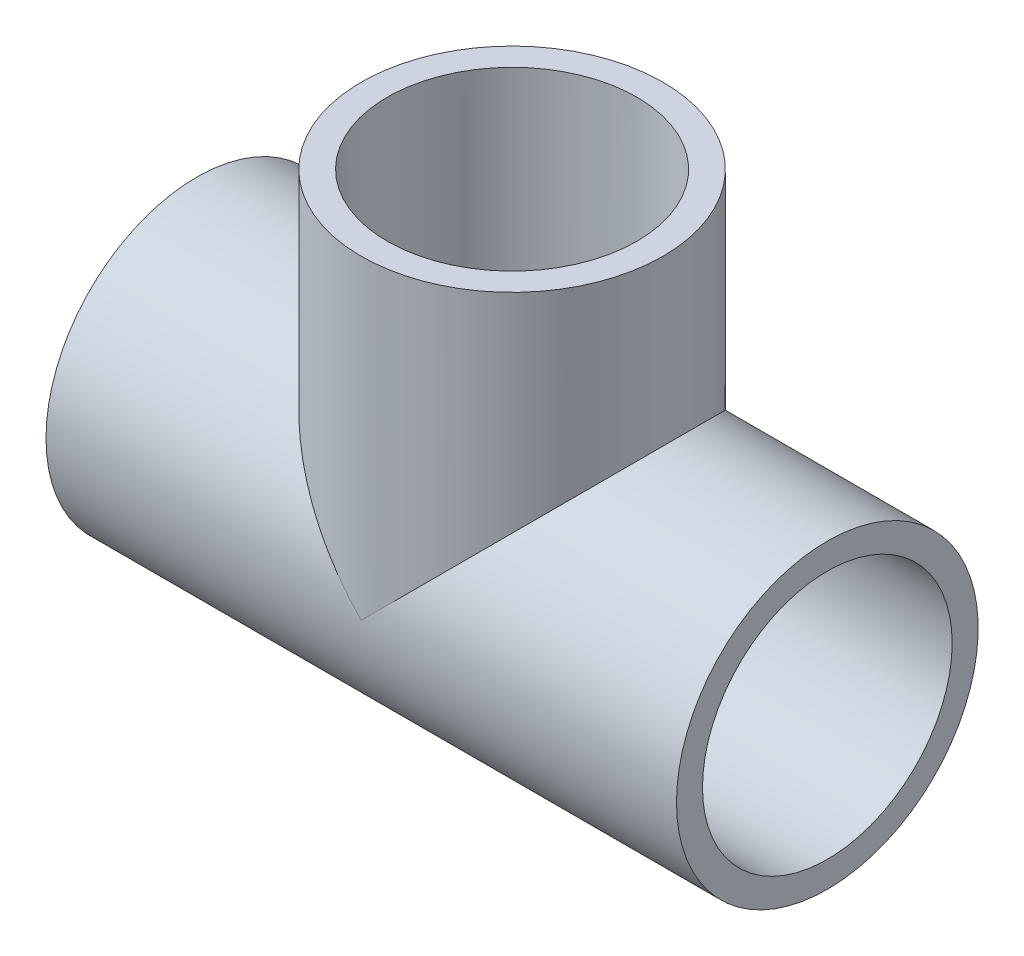
ISO-10303-21;
HEADER;
FILE_DESCRIPTION(('STEP AP214'),'2;1');
FILE_NAME('part.step','',(''),(''),'','','');
FILE_SCHEMA(('AUTOMOTIVE_DESIGN { 1 0 10303 214 1 1 1 1 }'));
ENDSEC;
DATA;
#1=APPLICATION_CONTEXT('core data for automotive mechanical design processes');
#2=APPLICATION_PROTOCOL_DEFINITION('international standard','automotive_design',2000,#1);
#3=PRODUCT_CONTEXT('',#1,'mechanical');
#4=PRODUCT('Part','Part','',(#3));
#5=PRODUCT_RELATED_PRODUCT_CATEGORY('part','',(#4));
#6=PRODUCT_DEFINITION_FORMATION('','',#4);
#7=PRODUCT_DEFINITION_CONTEXT('part definition',#1,'design');
#8=PRODUCT_DEFINITION('design','',#6,#7);
#9=PRODUCT_DEFINITION_SHAPE('','',#8);
#10=(LENGTH_UNIT() NAMED_UNIT(*) SI_UNIT(.MILLI.,.METRE.));
#11=(NAMED_UNIT(*) PLANE_ANGLE_UNIT() SI_UNIT($,.RADIAN.));
#12=(NAMED_UNIT(*) SI_UNIT($,.STERADIAN.) SOLID_ANGLE_UNIT());
#13=UNCERTAINTY_MEASURE_WITH_UNIT(LENGTH_MEASURE(1.E-05),#10,'distance_accuracy_value','');
#14=(GEOMETRIC_REPRESENTATION_CONTEXT(3) GLOBAL_UNCERTAINTY_ASSIGNED_CONTEXT((#13)) GLOBAL_UNIT_ASSIGNED_CONTEXT((#10,
#11,#12)) REPRESENTATION_CONTEXT('',''));
#15=CARTESIAN_POINT('',(0.,0.,0.));
#16=DIRECTION('',(0.,0.,1.));
#17=DIRECTION('',(1.,0.,0.));
#18=AXIS2_PLACEMENT_3D('',#15,#16,#17);
#19=CARTESIAN_POINT('',(-17.4752,0.,0.));
#20=DIRECTION('',(1.,0.,0.));
#21=DIRECTION('',(0.,0.,-1.));
#22=AXIS2_PLACEMENT_3D('',#19,#20,#21);
#23=PLANE('',#22);
#24=CARTESIAN_POINT('',(-17.4752,0.,0.));
#25=DIRECTION('',(-1.,0.,0.));
#26=DIRECTION('',(0.,0.,1.));
#27=AXIS2_PLACEMENT_3D('',#24,#25,#26);
#28=CIRCLE('',#27,16.637);
#29=CARTESIAN_POINT('',(-17.4752,0.,16.637));
#30=VERTEX_POINT('',#29);
#31=EDGE_CURVE('E88',#30,#30,#28,.T.);
#32=ORIENTED_EDGE('',*,*,#31,.T.);
#33=EDGE_LOOP('',(#32));
#34=FACE_BOUND('',#33,.T.);
#35=CARTESIAN_POINT('',(-17.4752,0.,0.));
#36=DIRECTION('',(1.,0.,0.));
#37=DIRECTION('',(0.,0.,-1.));
#38=AXIS2_PLACEMENT_3D('',#35,#36,#37);
#39=CIRCLE('',#38,13.3223);
#40=CARTESIAN_POINT('',(-17.4752,0.,-13.3223));
#41=VERTEX_POINT('',#40);
#42=EDGE_CURVE('E71',#41,#41,#39,.T.);
#43=ORIENTED_EDGE('',*,*,#42,.T.);
#44=EDGE_LOOP('',(#43));
#45=FACE_BOUND('',#44,.T.);
#46=ADVANCED_FACE('F32',(#34,#45),#23,.F.);
#47=CARTESIAN_POINT('',(17.4752,0.,0.));
#48=DIRECTION('',(1.,0.,0.));
#49=DIRECTION('',(0.,0.,-1.));
#50=AXIS2_PLACEMENT_3D('',#47,#48,#49);
#51=PLANE('',#50);
#52=CARTESIAN_POINT('',(17.4752,0.,0.));
#53=DIRECTION('',(1.,0.,0.));
#54=DIRECTION('',(0.,0.,-1.));
#55=AXIS2_PLACEMENT_3D('',#52,#53,#54);
#56=CIRCLE('',#55,13.3223);
#57=CARTESIAN_POINT('',(17.4752,0.,-13.3223));
#58=VERTEX_POINT('',#57);
#59=EDGE_CURVE('E68',#58,#58,#56,.T.);
#60=ORIENTED_EDGE('',*,*,#59,.F.);
#61=EDGE_LOOP('',(#60));
#62=FACE_BOUND('',#61,.T.);
#63=CARTESIAN_POINT('',(17.4752,0.,0.));
#64=DIRECTION('',(1.,0.,0.));
#65=DIRECTION('',(0.,0.,-1.));
#66=AXIS2_PLACEMENT_3D('',#63,#64,#65);
#67=CIRCLE('',#66,16.637);
#68=CARTESIAN_POINT('',(17.4752,0.,-16.637));
#69=VERTEX_POINT('',#68);
#70=EDGE_CURVE('E59',#69,#69,#67,.F.);
#71=ORIENTED_EDGE('',*,*,#70,.F.);
#72=EDGE_LOOP('',(#71));
#73=FACE_BOUND('',#72,.T.);
#74=ADVANCED_FACE('F110',(#62,#73),#51,.T.);
#75=CARTESIAN_POINT('',(17.4752,0.,0.));
#76=DIRECTION('',(-1.,0.,0.));
#77=DIRECTION('',(0.,0.,1.));
#78=AXIS2_PLACEMENT_3D('',#75,#76,#77);
#79=CYLINDRICAL_SURFACE('',#78,20.3327);
#80=CARTESIAN_POINT('',(-42.4942,0.,0.));
#81=DIRECTION('',(-1.,0.,0.));
#82=DIRECTION('',(0.,0.,1.));
#83=AXIS2_PLACEMENT_3D('',#80,#81,#82);
#84=CIRCLE('',#83,20.3327);
#85=CARTESIAN_POINT('',(-42.4942,0.,20.3327));
#86=VERTEX_POINT('',#85);
#87=EDGE_CURVE('E85',#86,#86,#84,.T.);
#88=ORIENTED_EDGE('',*,*,#87,.F.);
#89=EDGE_LOOP('',(#88));
#90=FACE_BOUND('',#89,.T.);
#91=CARTESIAN_POINT('',(42.4942,0.,0.));
#92=DIRECTION('',(-1.,0.,0.));
#93=DIRECTION('',(0.,0.,1.));
#94=AXIS2_PLACEMENT_3D('',#91,#92,#93);
#95=CIRCLE('',#94,20.3327);
#96=CARTESIAN_POINT('',(42.4942,0.,20.3327));
#97=VERTEX_POINT('',#96);
#98=EDGE_CURVE('E73',#97,#97,#95,.T.);
#99=ORIENTED_EDGE('',*,*,#98,.T.);
#100=EDGE_LOOP('',(#99));
#101=FACE_BOUND('',#100,.T.);
#102=CARTESIAN_POINT('',(0.,0.,0.));
#103=DIRECTION('',(-0.707106781186547,-0.707106781186547,0.));
#104=DIRECTION('',(0.707106781186547,-0.707106781186547,0.));
#105=AXIS2_PLACEMENT_3D('',#102,#103,#104);
#106=ELLIPSE('',#105,28.7547800996634,20.3327);
#107=CARTESIAN_POINT('',(0.,0.,20.3327));
#108=VERTEX_POINT('',#107);
#109=CARTESIAN_POINT('',(0.,0.,-20.3327));
#110=VERTEX_POINT('',#109);
#111=EDGE_CURVE('E94',#108,#110,#106,.T.);
#112=ORIENTED_EDGE('',*,*,#111,.T.);
#113=CARTESIAN_POINT('',(0.,0.,0.));
#114=DIRECTION('',(0.707106781186547,-0.707106781186547,0.));
#115=DIRECTION('',(-0.707106781186547,-0.707106781186547,0.));
#116=AXIS2_PLACEMENT_3D('',#113,#114,#115);
#117=ELLIPSE('',#116,28.7547800996634,20.3327);
#118=EDGE_CURVE('E51',#110,#108,#117,.T.);
#119=ORIENTED_EDGE('',*,*,#118,.T.);
#120=EDGE_LOOP('',(#112,#119));
#121=FACE_BOUND('',#120,.T.);
#122=ADVANCED_FACE('F112',(#90,#101,#121),#79,.T.);
#123=CARTESIAN_POINT('',(-17.4752,0.,0.));
#124=DIRECTION('',(-1.,0.,0.));
#125=DIRECTION('',(0.,0.,1.));
#126=AXIS2_PLACEMENT_3D('',#123,#124,#125);
#127=CONICAL_SURFACE('',#126,16.637,0.00761406605526405);
#128=CARTESIAN_POINT('',(-42.4942,0.,0.));
#129=DIRECTION('',(-1.,0.,0.));
#130=DIRECTION('',(0.,0.,1.));
#131=AXIS2_PLACEMENT_3D('',#128,#129,#130);
#132=CIRCLE('',#131,16.8275);
#133=CARTESIAN_POINT('',(-42.4942,0.,16.8275));
#134=VERTEX_POINT('',#133);
#135=EDGE_CURVE('E91',#134,#134,#132,.T.);
#136=ORIENTED_EDGE('',*,*,#135,.T.);
#137=EDGE_LOOP('',(#136));
#138=FACE_BOUND('',#137,.T.);
#139=ORIENTED_EDGE('',*,*,#31,.F.);
#140=EDGE_LOOP('',(#139));
#141=FACE_BOUND('',#140,.T.);
#142=ADVANCED_FACE('F119',(#138,#141),#127,.F.);
#143=CARTESIAN_POINT('',(42.4942,0.,0.));
#144=DIRECTION('',(1.,0.,0.));
#145=DIRECTION('',(0.,0.,-1.));
#146=AXIS2_PLACEMENT_3D('',#143,#144,#145);
#147=CONICAL_SURFACE('',#146,16.8275,0.00761406605526377);
#148=CARTESIAN_POINT('',(42.4942,0.,0.));
#149=DIRECTION('',(-1.,0.,0.));
#150=DIRECTION('',(0.,0.,1.));
#151=AXIS2_PLACEMENT_3D('',#148,#149,#150);
#152=CIRCLE('',#151,16.8275);
#153=CARTESIAN_POINT('',(42.4942,0.,16.8275));
#154=VERTEX_POINT('',#153);
#155=EDGE_CURVE('E76',#154,#154,#152,.T.);
#156=ORIENTED_EDGE('',*,*,#155,.F.);
#157=EDGE_LOOP('',(#156));
#158=FACE_BOUND('',#157,.T.);
#159=ORIENTED_EDGE('',*,*,#70,.T.);
#160=EDGE_LOOP('',(#159));
#161=FACE_BOUND('',#160,.T.);
#162=ADVANCED_FACE('F108',(#158,#161),#147,.F.);
#163=CARTESIAN_POINT('',(0.,42.4942,0.));
#164=DIRECTION('',(0.,1.,0.));
#165=DIRECTION('',(-1.,0.,0.));
#166=AXIS2_PLACEMENT_3D('',#163,#164,#165);
#167=CONICAL_SURFACE('',#166,16.8275,0.00761406605526404);
#168=CARTESIAN_POINT('',(0.,42.4942,0.));
#169=DIRECTION('',(0.,-1.,0.));
#170=DIRECTION('',(1.,0.,0.));
#171=AXIS2_PLACEMENT_3D('',#168,#169,#170);
#172=CIRCLE('',#171,16.8275);
#173=CARTESIAN_POINT('',(16.8275,42.4942,0.));
#174=VERTEX_POINT('',#173);
#175=EDGE_CURVE('E96',#174,#174,#172,.T.);
#176=ORIENTED_EDGE('',*,*,#175,.F.);
#177=EDGE_LOOP('',(#176));
#178=FACE_BOUND('',#177,.T.);
#179=CARTESIAN_POINT('',(0.,17.4752,0.));
#180=DIRECTION('',(0.,-1.,0.));
#181=DIRECTION('',(1.,0.,0.));
#182=AXIS2_PLACEMENT_3D('',#179,#180,#181);
#183=CIRCLE('',#182,16.637);
#184=CARTESIAN_POINT('',(16.637,17.4752,0.));
#185=VERTEX_POINT('',#184);
#186=EDGE_CURVE('E99',#185,#185,#183,.T.);
#187=ORIENTED_EDGE('',*,*,#186,.T.);
#188=EDGE_LOOP('',(#187));
#189=FACE_BOUND('',#188,.T.);
#190=ADVANCED_FACE('F128',(#178,#189),#167,.F.);
#191=CARTESIAN_POINT('',(20.3327,42.4942,0.));
#192=DIRECTION('',(0.,1.,0.));
#193=DIRECTION('',(-1.,0.,0.));
#194=AXIS2_PLACEMENT_3D('',#191,#192,#193);
#195=PLANE('',#194);
#196=ORIENTED_EDGE('',*,*,#175,.T.);
#197=EDGE_LOOP('',(#196));
#198=FACE_BOUND('',#197,.T.);
#199=CARTESIAN_POINT('',(0.,42.4942,0.));
#200=DIRECTION('',(0.,-1.,0.));
#201=DIRECTION('',(1.,0.,0.));
#202=AXIS2_PLACEMENT_3D('',#199,#200,#201);
#203=CIRCLE('',#202,20.3327);
#204=CARTESIAN_POINT('',(20.3327,42.4942,0.));
#205=VERTEX_POINT('',#204);
#206=EDGE_CURVE('E102',#205,#205,#203,.T.);
#207=ORIENTED_EDGE('',*,*,#206,.F.);
#208=EDGE_LOOP('',(#207));
#209=FACE_BOUND('',#208,.T.);
#210=ADVANCED_FACE('F34',(#198,#209),#195,.T.);
#211=CARTESIAN_POINT('',(0.,0.,0.));
#212=DIRECTION('',(0.,-1.,0.));
#213=DIRECTION('',(1.,0.,0.));
#214=AXIS2_PLACEMENT_3D('',#211,#212,#213);
#215=CYLINDRICAL_SURFACE('',#214,20.3327);
#216=ORIENTED_EDGE('',*,*,#118,.F.);
#217=ORIENTED_EDGE('',*,*,#111,.F.);
#218=EDGE_LOOP('',(#216,#217));
#219=FACE_BOUND('',#218,.T.);
#220=ORIENTED_EDGE('',*,*,#206,.T.);
#221=EDGE_LOOP('',(#220));
#222=FACE_BOUND('',#221,.T.);
#223=ADVANCED_FACE('F131',(#219,#222),#215,.T.);
#224=CARTESIAN_POINT('',(-42.4942,-20.3327,0.));
#225=DIRECTION('',(-1.,0.,0.));
#226=DIRECTION('',(0.,0.,1.));
#227=AXIS2_PLACEMENT_3D('',#224,#225,#226);
#228=PLANE('',#227);
#229=ORIENTED_EDGE('',*,*,#87,.T.);
#230=EDGE_LOOP('',(#229));
#231=FACE_BOUND('',#230,.T.);
#232=ORIENTED_EDGE('',*,*,#135,.F.);
#233=EDGE_LOOP('',(#232));
#234=FACE_BOUND('',#233,.T.);
#235=ADVANCED_FACE('F125',(#231,#234),#228,.T.);
#236=CARTESIAN_POINT('',(42.4942,-20.3327,0.));
#237=DIRECTION('',(1.,0.,0.));
#238=DIRECTION('',(0.,0.,-1.));
#239=AXIS2_PLACEMENT_3D('',#236,#237,#238);
#240=PLANE('',#239);
#241=ORIENTED_EDGE('',*,*,#155,.T.);
#242=EDGE_LOOP('',(#241));
#243=FACE_BOUND('',#242,.T.);
#244=ORIENTED_EDGE('',*,*,#98,.F.);
#245=EDGE_LOOP('',(#244));
#246=FACE_BOUND('',#245,.T.);
#247=ADVANCED_FACE('F137',(#243,#246),#240,.T.);
#248=CARTESIAN_POINT('',(0.,17.4752,0.));
#249=DIRECTION('',(0.,-1.,0.));
#250=DIRECTION('',(1.,0.,0.));
#251=AXIS2_PLACEMENT_3D('',#248,#249,#250);
#252=PLANE('',#251);
#253=CARTESIAN_POINT('',(0.,17.4752,0.));
#254=DIRECTION('',(0.,-1.,0.));
#255=DIRECTION('',(0.,0.,-1.));
#256=AXIS2_PLACEMENT_3D('',#253,#254,#255);
#257=CIRCLE('',#256,13.3223);
#258=CARTESIAN_POINT('',(0.,17.4752,-13.3223));
#259=VERTEX_POINT('',#258);
#260=EDGE_CURVE('E78',#259,#259,#257,.T.);
#261=ORIENTED_EDGE('',*,*,#260,.T.);
#262=EDGE_LOOP('',(#261));
#263=FACE_BOUND('',#262,.T.);
#264=ORIENTED_EDGE('',*,*,#186,.F.);
#265=EDGE_LOOP('',(#264));
#266=FACE_BOUND('',#265,.T.);
#267=ADVANCED_FACE('F63',(#263,#266),#252,.F.);
#268=CARTESIAN_POINT('',(42.4942,0.,0.));
#269=DIRECTION('',(1.,0.,0.));
#270=DIRECTION('',(0.,0.,-1.));
#271=AXIS2_PLACEMENT_3D('',#268,#269,#270);
#272=CYLINDRICAL_SURFACE('',#271,13.3223);
#273=CARTESIAN_POINT('',(0.,0.,0.));
#274=DIRECTION('',(0.707106781186547,-0.707106781186547,0.));
#275=DIRECTION('',(0.707106781186547,0.707106781186547,0.));
#276=AXIS2_PLACEMENT_3D('',#273,#274,#275);
#277=ELLIPSE('',#276,18.8405773420031,13.3223);
#278=CARTESIAN_POINT('',(0.,0.,-13.3223));
#279=VERTEX_POINT('',#278);
#280=CARTESIAN_POINT('',(0.,0.,13.3223));
#281=VERTEX_POINT('',#280);
#282=EDGE_CURVE('E11',#279,#281,#277,.T.);
#283=ORIENTED_EDGE('',*,*,#282,.F.);
#284=CARTESIAN_POINT('',(0.,0.,0.));
#285=DIRECTION('',(0.707106781186547,0.707106781186547,0.));
#286=DIRECTION('',(0.707106781186547,-0.707106781186547,0.));
#287=AXIS2_PLACEMENT_3D('',#284,#285,#286);
#288=ELLIPSE('',#287,18.8405773420031,13.3223);
#289=EDGE_CURVE('E40',#281,#279,#288,.F.);
#290=ORIENTED_EDGE('',*,*,#289,.F.);
#291=EDGE_LOOP('',(#283,#290));
#292=FACE_BOUND('',#291,.T.);
#293=ORIENTED_EDGE('',*,*,#59,.T.);
#294=EDGE_LOOP('',(#293));
#295=FACE_BOUND('',#294,.T.);
#296=ORIENTED_EDGE('',*,*,#42,.F.);
#297=EDGE_LOOP('',(#296));
#298=FACE_BOUND('',#297,.T.);
#299=ADVANCED_FACE('F60',(#292,#295,#298),#272,.F.);
#300=CARTESIAN_POINT('',(0.,0.,0.));
#301=DIRECTION('',(0.,-1.,0.));
#302=DIRECTION('',(0.,0.,-1.));
#303=AXIS2_PLACEMENT_3D('',#300,#301,#302);
#304=CYLINDRICAL_SURFACE('',#303,13.3223);
#305=ORIENTED_EDGE('',*,*,#282,.T.);
#306=ORIENTED_EDGE('',*,*,#289,.T.);
#307=EDGE_LOOP('',(#305,#306));
#308=FACE_BOUND('',#307,.T.);
#309=ORIENTED_EDGE('',*,*,#260,.F.);
#310=EDGE_LOOP('',(#309));
#311=FACE_BOUND('',#310,.T.);
#312=ADVANCED_FACE('F56',(#308,#311),#304,.F.);
#313=CLOSED_SHELL('',(#46,#74,#122,#142,#162,#190,#210,#223,#235,#247,#267,#299,#312));
#314=MANIFOLD_SOLID_BREP('B2',#313);
#315=ADVANCED_BREP_SHAPE_REPRESENTATION('',(#18,#314),#14);
#316=SHAPE_DEFINITION_REPRESENTATION(#9,#315);
ENDSEC;
END-ISO-10303-21;
